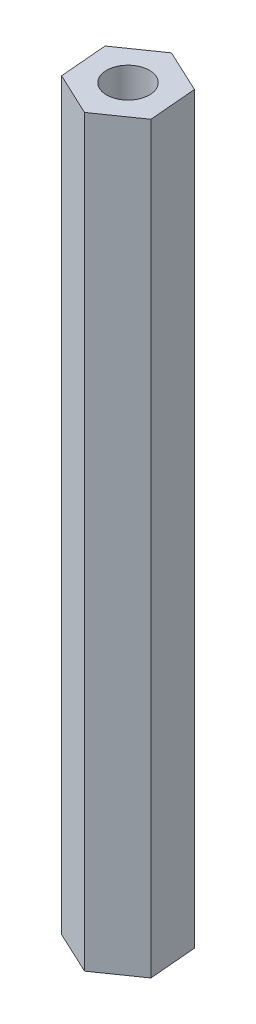
ISO-10303-21;
HEADER;
FILE_DESCRIPTION(('STEP AP214'),'2;1');
FILE_NAME('part.step','',(''),(''),'','','');
FILE_SCHEMA(('AUTOMOTIVE_DESIGN { 1 0 10303 214 1 1 1 1 }'));
ENDSEC;
DATA;
#1=APPLICATION_CONTEXT('core data for automotive mechanical design processes');
#2=APPLICATION_PROTOCOL_DEFINITION('international standard','automotive_design',2000,#1);
#3=PRODUCT_CONTEXT('',#1,'mechanical');
#4=PRODUCT('Part','Part','',(#3));
#5=PRODUCT_RELATED_PRODUCT_CATEGORY('part','',(#4));
#6=PRODUCT_DEFINITION_FORMATION('','',#4);
#7=PRODUCT_DEFINITION_CONTEXT('part definition',#1,'design');
#8=PRODUCT_DEFINITION('design','',#6,#7);
#9=PRODUCT_DEFINITION_SHAPE('','',#8);
#10=(LENGTH_UNIT() NAMED_UNIT(*) SI_UNIT(.MILLI.,.METRE.));
#11=(NAMED_UNIT(*) PLANE_ANGLE_UNIT() SI_UNIT($,.RADIAN.));
#12=(NAMED_UNIT(*) SI_UNIT($,.STERADIAN.) SOLID_ANGLE_UNIT());
#13=UNCERTAINTY_MEASURE_WITH_UNIT(LENGTH_MEASURE(1.E-05),#10,'distance_accuracy_value','');
#14=(GEOMETRIC_REPRESENTATION_CONTEXT(3) GLOBAL_UNCERTAINTY_ASSIGNED_CONTEXT((#13)) GLOBAL_UNIT_ASSIGNED_CONTEXT((#10,
#11,#12)) REPRESENTATION_CONTEXT('',''));
#15=CARTESIAN_POINT('',(0.,0.,0.));
#16=DIRECTION('',(0.,0.,1.));
#17=DIRECTION('',(1.,0.,0.));
#18=AXIS2_PLACEMENT_3D('',#15,#16,#17);
#19=CARTESIAN_POINT('',(6.63779157318112,57.15,3.11497293155798));
#20=DIRECTION('',(-0.996404177212739,0.,0.0847273015798542));
#21=DIRECTION('',(0.0847273015798542,0.,0.99640417721274));
#22=AXIS2_PLACEMENT_3D('',#19,#20,#21);
#23=PLANE('',#22);
#24=DIRECTION('',(-0.0847273015798542,0.,-0.99640417721274));
#25=VECTOR('',#24,1.);
#26=CARTESIAN_POINT('',(6.63779157318112,-57.15,3.11497293155798));
#27=LINE('',#26,#25);
#28=CARTESIAN_POINT('',(6.63779157318112,-57.15,3.11497293155798));
#29=VERTEX_POINT('',#28);
#30=CARTESIAN_POINT('',(6.01654147742066,-57.15,-4.19100966162214));
#31=VERTEX_POINT('',#30);
#32=EDGE_CURVE('E128',#29,#31,#27,.T.);
#33=ORIENTED_EDGE('',*,*,#32,.T.);
#34=DIRECTION('',(0.,-1.,0.));
#35=VECTOR('',#34,1.);
#36=CARTESIAN_POINT('',(6.01654147742066,57.15,-4.19100966162214));
#37=LINE('',#36,#35);
#38=CARTESIAN_POINT('',(6.01654147742066,57.15,-4.19100966162214));
#39=VERTEX_POINT('',#38);
#40=EDGE_CURVE('E11',#39,#31,#37,.T.);
#41=ORIENTED_EDGE('',*,*,#40,.F.);
#42=DIRECTION('',(-0.0847273015798542,0.,-0.99640417721274));
#43=VECTOR('',#42,1.);
#44=CARTESIAN_POINT('',(6.63779157318112,57.15,3.11497293155798));
#45=LINE('',#44,#43);
#46=CARTESIAN_POINT('',(6.63779157318112,57.15,3.11497293155798));
#47=VERTEX_POINT('',#46);
#48=EDGE_CURVE('E145',#47,#39,#45,.T.);
#49=ORIENTED_EDGE('',*,*,#48,.F.);
#50=DIRECTION('',(0.,-1.,0.));
#51=VECTOR('',#50,1.);
#52=CARTESIAN_POINT('',(6.63779157318112,57.15,3.11497293155798));
#53=LINE('',#52,#51);
#54=EDGE_CURVE('E124',#47,#29,#53,.T.);
#55=ORIENTED_EDGE('',*,*,#54,.T.);
#56=EDGE_LOOP('',(#33,#41,#49,#55));
#57=FACE_BOUND('',#56,.T.);
#58=ADVANCED_FACE('F39',(#57),#23,.F.);
#59=CARTESIAN_POINT('',(6.01654147742066,57.15,-4.19100966162214));
#60=DIRECTION('',(-0.42482609304411,0.,0.905274980693091));
#61=DIRECTION('',(0.905274980693091,0.,0.424826093044111));
#62=AXIS2_PLACEMENT_3D('',#59,#60,#61);
#63=PLANE('',#62);
#64=DIRECTION('',(-0.905274980693091,0.,-0.42482609304411));
#65=VECTOR('',#64,1.);
#66=CARTESIAN_POINT('',(6.01654147742066,-57.15,-4.19100966162214));
#67=LINE('',#66,#65);
#68=CARTESIAN_POINT('',(-0.62125009576046,-57.15,-7.30598259318012));
#69=VERTEX_POINT('',#68);
#70=EDGE_CURVE('E132',#31,#69,#67,.T.);
#71=ORIENTED_EDGE('',*,*,#70,.T.);
#72=DIRECTION('',(0.,-1.,0.));
#73=VECTOR('',#72,1.);
#74=CARTESIAN_POINT('',(-0.62125009576046,57.15,-7.30598259318012));
#75=LINE('',#74,#73);
#76=CARTESIAN_POINT('',(-0.62125009576046,57.15,-7.30598259318012));
#77=VERTEX_POINT('',#76);
#78=EDGE_CURVE('E48',#77,#69,#75,.T.);
#79=ORIENTED_EDGE('',*,*,#78,.F.);
#80=DIRECTION('',(-0.905274980693091,0.,-0.42482609304411));
#81=VECTOR('',#80,1.);
#82=CARTESIAN_POINT('',(6.01654147742066,57.15,-4.19100966162214));
#83=LINE('',#82,#81);
#84=EDGE_CURVE('E93',#39,#77,#83,.T.);
#85=ORIENTED_EDGE('',*,*,#84,.F.);
#86=ORIENTED_EDGE('',*,*,#40,.T.);
#87=EDGE_LOOP('',(#71,#79,#85,#86));
#88=FACE_BOUND('',#87,.T.);
#89=ADVANCED_FACE('F174',(#88),#63,.F.);
#90=CARTESIAN_POINT('',(-0.62125009576046,57.15,-7.30598259318012));
#91=DIRECTION('',(0.571578084168629,0.,0.820547679113237));
#92=DIRECTION('',(0.820547679113237,0.,-0.571578084168629));
#93=AXIS2_PLACEMENT_3D('',#90,#91,#92);
#94=PLANE('',#93);
#95=DIRECTION('',(-0.820547679113237,0.,0.571578084168629));
#96=VECTOR('',#95,1.);
#97=CARTESIAN_POINT('',(-0.62125009576046,-57.15,-7.30598259318012));
#98=LINE('',#97,#96);
#99=CARTESIAN_POINT('',(-6.63779157318112,-57.15,-3.11497293155798));
#100=VERTEX_POINT('',#99);
#101=EDGE_CURVE('E136',#69,#100,#98,.T.);
#102=ORIENTED_EDGE('',*,*,#101,.T.);
#103=DIRECTION('',(0.,-1.,0.));
#104=VECTOR('',#103,1.);
#105=CARTESIAN_POINT('',(-6.63779157318112,57.15,-3.11497293155798));
#106=LINE('',#105,#104);
#107=CARTESIAN_POINT('',(-6.63779157318112,57.15,-3.11497293155798));
#108=VERTEX_POINT('',#107);
#109=EDGE_CURVE('E117',#108,#100,#106,.T.);
#110=ORIENTED_EDGE('',*,*,#109,.F.);
#111=DIRECTION('',(-0.820547679113237,0.,0.571578084168629));
#112=VECTOR('',#111,1.);
#113=CARTESIAN_POINT('',(-0.62125009576046,57.15,-7.30598259318012));
#114=LINE('',#113,#112);
#115=EDGE_CURVE('E106',#77,#108,#114,.T.);
#116=ORIENTED_EDGE('',*,*,#115,.F.);
#117=ORIENTED_EDGE('',*,*,#78,.T.);
#118=EDGE_LOOP('',(#102,#110,#116,#117));
#119=FACE_BOUND('',#118,.T.);
#120=ADVANCED_FACE('F155',(#119),#94,.F.);
#121=CARTESIAN_POINT('',(-6.63779157318112,57.15,-3.11497293155798));
#122=DIRECTION('',(0.996404177212739,0.,-0.0847273015798547));
#123=DIRECTION('',(-0.0847273015798547,0.,-0.99640417721274));
#124=AXIS2_PLACEMENT_3D('',#121,#122,#123);
#125=PLANE('',#124);
#126=DIRECTION('',(0.0847273015798547,0.,0.99640417721274));
#127=VECTOR('',#126,1.);
#128=CARTESIAN_POINT('',(-6.63779157318112,-57.15,-3.11497293155798));
#129=LINE('',#128,#127);
#130=CARTESIAN_POINT('',(-6.01654147742066,-57.15,4.19100966162213));
#131=VERTEX_POINT('',#130);
#132=EDGE_CURVE('E115',#100,#131,#129,.T.);
#133=ORIENTED_EDGE('',*,*,#132,.T.);
#134=DIRECTION('',(0.,-1.,0.));
#135=VECTOR('',#134,1.);
#136=CARTESIAN_POINT('',(-6.01654147742066,57.15,4.19100966162213));
#137=LINE('',#136,#135);
#138=CARTESIAN_POINT('',(-6.01654147742066,57.15,4.19100966162213));
#139=VERTEX_POINT('',#138);
#140=EDGE_CURVE('E112',#139,#131,#137,.T.);
#141=ORIENTED_EDGE('',*,*,#140,.F.);
#142=DIRECTION('',(0.0847273015798547,0.,0.99640417721274));
#143=VECTOR('',#142,1.);
#144=CARTESIAN_POINT('',(-6.63779157318112,57.15,-3.11497293155798));
#145=LINE('',#144,#143);
#146=EDGE_CURVE('E100',#108,#139,#145,.T.);
#147=ORIENTED_EDGE('',*,*,#146,.F.);
#148=ORIENTED_EDGE('',*,*,#109,.T.);
#149=EDGE_LOOP('',(#133,#141,#147,#148));
#150=FACE_BOUND('',#149,.T.);
#151=ADVANCED_FACE('F113',(#150),#125,.F.);
#152=CARTESIAN_POINT('',(-6.01654147742066,57.15,4.19100966162213));
#153=DIRECTION('',(0.424826093044111,0.,-0.905274980693091));
#154=DIRECTION('',(-0.905274980693091,0.,-0.424826093044111));
#155=AXIS2_PLACEMENT_3D('',#152,#153,#154);
#156=PLANE('',#155);
#157=DIRECTION('',(0.905274980693091,0.,0.424826093044111));
#158=VECTOR('',#157,1.);
#159=CARTESIAN_POINT('',(-6.01654147742066,-57.15,4.19100966162213));
#160=LINE('',#159,#158);
#161=CARTESIAN_POINT('',(0.621250095760461,-57.15,7.30598259318012));
#162=VERTEX_POINT('',#161);
#163=EDGE_CURVE('E79',#131,#162,#160,.T.);
#164=ORIENTED_EDGE('',*,*,#163,.T.);
#165=DIRECTION('',(0.,-1.,0.));
#166=VECTOR('',#165,1.);
#167=CARTESIAN_POINT('',(0.621250095760461,57.15,7.30598259318012));
#168=LINE('',#167,#166);
#169=CARTESIAN_POINT('',(0.621250095760461,57.15,7.30598259318012));
#170=VERTEX_POINT('',#169);
#171=EDGE_CURVE('E118',#170,#162,#168,.T.);
#172=ORIENTED_EDGE('',*,*,#171,.F.);
#173=DIRECTION('',(0.905274980693091,0.,0.424826093044111));
#174=VECTOR('',#173,1.);
#175=CARTESIAN_POINT('',(-6.01654147742066,57.15,4.19100966162213));
#176=LINE('',#175,#174);
#177=EDGE_CURVE('E104',#139,#170,#176,.T.);
#178=ORIENTED_EDGE('',*,*,#177,.F.);
#179=ORIENTED_EDGE('',*,*,#140,.T.);
#180=EDGE_LOOP('',(#164,#172,#178,#179));
#181=FACE_BOUND('',#180,.T.);
#182=ADVANCED_FACE('F120',(#181),#156,.F.);
#183=CARTESIAN_POINT('',(0.621250095760461,57.15,7.30598259318012));
#184=DIRECTION('',(-0.571578084168629,0.,-0.820547679113237));
#185=DIRECTION('',(-0.820547679113237,0.,0.571578084168629));
#186=AXIS2_PLACEMENT_3D('',#183,#184,#185);
#187=PLANE('',#186);
#188=DIRECTION('',(0.820547679113237,0.,-0.571578084168629));
#189=VECTOR('',#188,1.);
#190=CARTESIAN_POINT('',(0.621250095760461,-57.15,7.30598259318012));
#191=LINE('',#190,#189);
#192=EDGE_CURVE('E85',#162,#29,#191,.T.);
#193=ORIENTED_EDGE('',*,*,#192,.T.);
#194=ORIENTED_EDGE('',*,*,#54,.F.);
#195=DIRECTION('',(0.820547679113237,0.,-0.571578084168629));
#196=VECTOR('',#195,1.);
#197=CARTESIAN_POINT('',(0.621250095760461,57.15,7.30598259318012));
#198=LINE('',#197,#196);
#199=EDGE_CURVE('E56',#170,#47,#198,.T.);
#200=ORIENTED_EDGE('',*,*,#199,.F.);
#201=ORIENTED_EDGE('',*,*,#171,.T.);
#202=EDGE_LOOP('',(#193,#194,#200,#201));
#203=FACE_BOUND('',#202,.T.);
#204=ADVANCED_FACE('F162',(#203),#187,.F.);
#205=CARTESIAN_POINT('',(0.,57.15,0.));
#206=DIRECTION('',(0.,1.,0.));
#207=DIRECTION('',(0.,0.,1.));
#208=AXIS2_PLACEMENT_3D('',#205,#206,#207);
#209=PLANE('',#208);
#210=CARTESIAN_POINT('',(0.,57.15,0.));
#211=DIRECTION('',(0.,1.,0.));
#212=DIRECTION('',(0.,0.,1.));
#213=AXIS2_PLACEMENT_3D('',#210,#211,#212);
#214=CIRCLE('',#213,3.2893);
#215=CARTESIAN_POINT('',(0.,57.15,3.2893));
#216=VERTEX_POINT('',#215);
#217=EDGE_CURVE('E258',#216,#216,#214,.T.);
#218=ORIENTED_EDGE('',*,*,#217,.F.);
#219=EDGE_LOOP('',(#218));
#220=FACE_BOUND('',#219,.T.);
#221=ORIENTED_EDGE('',*,*,#48,.T.);
#222=ORIENTED_EDGE('',*,*,#84,.T.);
#223=ORIENTED_EDGE('',*,*,#115,.T.);
#224=ORIENTED_EDGE('',*,*,#146,.T.);
#225=ORIENTED_EDGE('',*,*,#177,.T.);
#226=ORIENTED_EDGE('',*,*,#199,.T.);
#227=EDGE_LOOP('',(#221,#222,#223,#224,#225,#226));
#228=FACE_BOUND('',#227,.T.);
#229=ADVANCED_FACE('F102',(#220,#228),#209,.T.);
#230=CARTESIAN_POINT('',(0.,-57.15,0.));
#231=DIRECTION('',(0.,1.,0.));
#232=DIRECTION('',(0.,0.,1.));
#233=AXIS2_PLACEMENT_3D('',#230,#231,#232);
#234=PLANE('',#233);
#235=CARTESIAN_POINT('',(0.,-57.15,0.));
#236=DIRECTION('',(0.,1.,0.));
#237=DIRECTION('',(0.,0.,1.));
#238=AXIS2_PLACEMENT_3D('',#235,#236,#237);
#239=CIRCLE('',#238,3.2893);
#240=CARTESIAN_POINT('',(0.,-57.15,3.2893));
#241=VERTEX_POINT('',#240);
#242=EDGE_CURVE('E259',#241,#241,#239,.T.);
#243=ORIENTED_EDGE('',*,*,#242,.T.);
#244=EDGE_LOOP('',(#243));
#245=FACE_BOUND('',#244,.T.);
#246=ORIENTED_EDGE('',*,*,#32,.F.);
#247=ORIENTED_EDGE('',*,*,#192,.F.);
#248=ORIENTED_EDGE('',*,*,#163,.F.);
#249=ORIENTED_EDGE('',*,*,#132,.F.);
#250=ORIENTED_EDGE('',*,*,#101,.F.);
#251=ORIENTED_EDGE('',*,*,#70,.F.);
#252=EDGE_LOOP('',(#246,#247,#248,#249,#250,#251));
#253=FACE_BOUND('',#252,.T.);
#254=ADVANCED_FACE('F158',(#245,#253),#234,.F.);
#255=CARTESIAN_POINT('',(0.,44.45,0.));
#256=DIRECTION('',(0.,1.,0.));
#257=DIRECTION('',(0.,0.,1.));
#258=AXIS2_PLACEMENT_3D('',#255,#256,#257);
#259=CYLINDRICAL_SURFACE('',#258,3.2893);
#260=CARTESIAN_POINT('',(0.,44.45,0.));
#261=DIRECTION('',(0.,1.,0.));
#262=DIRECTION('',(0.,0.,1.));
#263=AXIS2_PLACEMENT_3D('',#260,#261,#262);
#264=CIRCLE('',#263,3.2893);
#265=CARTESIAN_POINT('',(0.,44.45,3.2893));
#266=VERTEX_POINT('',#265);
#267=EDGE_CURVE('E133',#266,#266,#264,.T.);
#268=ORIENTED_EDGE('',*,*,#267,.F.);
#269=EDGE_LOOP('',(#268));
#270=FACE_BOUND('',#269,.T.);
#271=ORIENTED_EDGE('',*,*,#217,.T.);
#272=EDGE_LOOP('',(#271));
#273=FACE_BOUND('',#272,.T.);
#274=ADVANCED_FACE('F209',(#270,#273),#259,.F.);
#275=CARTESIAN_POINT('',(0.,44.45,0.));
#276=DIRECTION('',(0.,1.,0.));
#277=DIRECTION('',(0.,0.,1.));
#278=AXIS2_PLACEMENT_3D('',#275,#276,#277);
#279=PLANE('',#278);
#280=ORIENTED_EDGE('',*,*,#267,.T.);
#281=EDGE_LOOP('',(#280));
#282=FACE_BOUND('',#281,.T.);
#283=ADVANCED_FACE('F214',(#282),#279,.T.);
#284=CARTESIAN_POINT('',(0.,-44.45,0.));
#285=DIRECTION('',(0.,-1.,0.));
#286=DIRECTION('',(0.,0.,-1.));
#287=AXIS2_PLACEMENT_3D('',#284,#285,#286);
#288=CYLINDRICAL_SURFACE('',#287,3.2893);
#289=CARTESIAN_POINT('',(0.,-44.45,0.));
#290=DIRECTION('',(0.,1.,0.));
#291=DIRECTION('',(0.,0.,1.));
#292=AXIS2_PLACEMENT_3D('',#289,#290,#291);
#293=CIRCLE('',#292,3.2893);
#294=CARTESIAN_POINT('',(0.,-44.45,3.2893));
#295=VERTEX_POINT('',#294);
#296=EDGE_CURVE('E256',#295,#295,#293,.T.);
#297=ORIENTED_EDGE('',*,*,#296,.T.);
#298=EDGE_LOOP('',(#297));
#299=FACE_BOUND('',#298,.T.);
#300=ORIENTED_EDGE('',*,*,#242,.F.);
#301=EDGE_LOOP('',(#300));
#302=FACE_BOUND('',#301,.T.);
#303=ADVANCED_FACE('F224',(#299,#302),#288,.F.);
#304=CARTESIAN_POINT('',(0.,-44.45,0.));
#305=DIRECTION('',(0.,-1.,0.));
#306=DIRECTION('',(0.,0.,1.));
#307=AXIS2_PLACEMENT_3D('',#304,#305,#306);
#308=PLANE('',#307);
#309=ORIENTED_EDGE('',*,*,#296,.F.);
#310=EDGE_LOOP('',(#309));
#311=FACE_BOUND('',#310,.T.);
#312=ADVANCED_FACE('F240',(#311),#308,.T.);
#313=CLOSED_SHELL('',(#58,#89,#120,#151,#182,#204,#229,#254,#274,#283,#303,#312));
#314=MANIFOLD_SOLID_BREP('B2',#313);
#315=ADVANCED_BREP_SHAPE_REPRESENTATION('',(#18,#314),#14);
#316=SHAPE_DEFINITION_REPRESENTATION(#9,#315);
ENDSEC;
END-ISO-10303-21;
